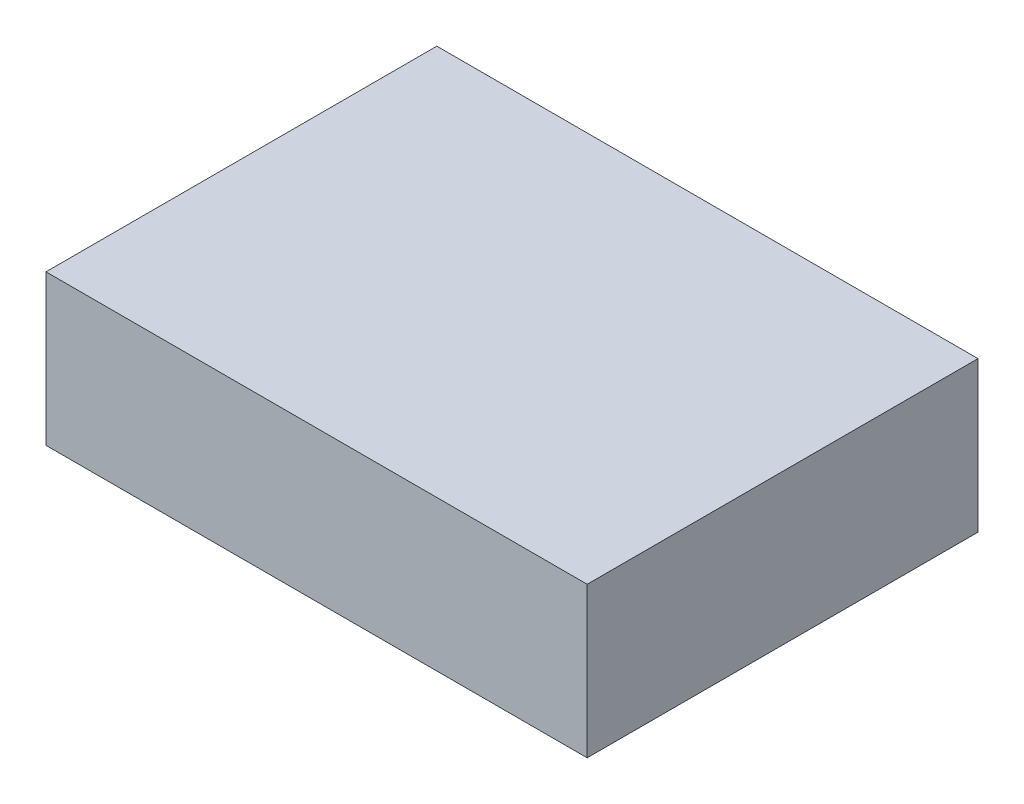
ISO-10303-21;
HEADER;
FILE_DESCRIPTION(('STEP AP214'),'2;1');
FILE_NAME('part.step','',(''),(''),'','','');
FILE_SCHEMA(('AUTOMOTIVE_DESIGN { 1 0 10303 214 1 1 1 1 }'));
ENDSEC;
DATA;
#1=APPLICATION_CONTEXT('core data for automotive mechanical design processes');
#2=APPLICATION_PROTOCOL_DEFINITION('international standard','automotive_design',2000,#1);
#3=PRODUCT_CONTEXT('',#1,'mechanical');
#4=PRODUCT('Part','Part','',(#3));
#5=PRODUCT_RELATED_PRODUCT_CATEGORY('part','',(#4));
#6=PRODUCT_DEFINITION_FORMATION('','',#4);
#7=PRODUCT_DEFINITION_CONTEXT('part definition',#1,'design');
#8=PRODUCT_DEFINITION('design','',#6,#7);
#9=PRODUCT_DEFINITION_SHAPE('','',#8);
#10=(LENGTH_UNIT() NAMED_UNIT(*) SI_UNIT(.MILLI.,.METRE.));
#11=(NAMED_UNIT(*) PLANE_ANGLE_UNIT() SI_UNIT($,.RADIAN.));
#12=(NAMED_UNIT(*) SI_UNIT($,.STERADIAN.) SOLID_ANGLE_UNIT());
#13=UNCERTAINTY_MEASURE_WITH_UNIT(LENGTH_MEASURE(1.E-05),#10,'distance_accuracy_value','');
#14=(GEOMETRIC_REPRESENTATION_CONTEXT(3) GLOBAL_UNCERTAINTY_ASSIGNED_CONTEXT((#13)) GLOBAL_UNIT_ASSIGNED_CONTEXT((#10,
#11,#12)) REPRESENTATION_CONTEXT('',''));
#15=CARTESIAN_POINT('',(0.,0.,0.));
#16=DIRECTION('',(0.,0.,1.));
#17=DIRECTION('',(1.,0.,0.));
#18=AXIS2_PLACEMENT_3D('',#15,#16,#17);
#19=CARTESIAN_POINT('',(0.90000074,0.25000204,0.));
#20=DIRECTION('',(0.,-1.,0.));
#21=DIRECTION('',(0.,0.,-1.));
#22=AXIS2_PLACEMENT_3D('',#19,#20,#21);
#23=PLANE('',#22);
#24=DIRECTION('',(0.,0.,-1.));
#25=VECTOR('',#24,1.);
#26=CARTESIAN_POINT('',(-0.8999982,0.25000204,0.));
#27=LINE('',#26,#25);
#28=CARTESIAN_POINT('',(-0.8999982,0.25000204,0.));
#29=VERTEX_POINT('',#28);
#30=CARTESIAN_POINT('',(-0.8999982,0.25000204,1.29999994));
#31=VERTEX_POINT('',#30);
#32=EDGE_CURVE('E20',#29,#31,#27,.F.);
#33=ORIENTED_EDGE('',*,*,#32,.T.);
#34=DIRECTION('',(-1.,0.,0.));
#35=VECTOR('',#34,1.);
#36=CARTESIAN_POINT('',(-0.8999982,0.25000204,1.29999994));
#37=LINE('',#36,#35);
#38=CARTESIAN_POINT('',(0.90000074,0.25000204,1.29999994));
#39=VERTEX_POINT('',#38);
#40=EDGE_CURVE('E55',#31,#39,#37,.F.);
#41=ORIENTED_EDGE('',*,*,#40,.T.);
#42=DIRECTION('',(0.,0.,1.));
#43=VECTOR('',#42,1.);
#44=CARTESIAN_POINT('',(0.90000074,0.25000204,0.));
#45=LINE('',#44,#43);
#46=CARTESIAN_POINT('',(0.90000074,0.25000204,0.));
#47=VERTEX_POINT('',#46);
#48=EDGE_CURVE('E76',#39,#47,#45,.F.);
#49=ORIENTED_EDGE('',*,*,#48,.T.);
#50=DIRECTION('',(-1.,0.,0.));
#51=VECTOR('',#50,1.);
#52=CARTESIAN_POINT('',(-0.8999982,0.25000204,0.));
#53=LINE('',#52,#51);
#54=EDGE_CURVE('E58',#29,#47,#53,.F.);
#55=ORIENTED_EDGE('',*,*,#54,.F.);
#56=EDGE_LOOP('',(#33,#41,#49,#55));
#57=FACE_BOUND('',#56,.T.);
#58=ADVANCED_FACE('F17',(#57),#23,.F.);
#59=CARTESIAN_POINT('',(-0.8999982,0.25000204,0.));
#60=DIRECTION('',(1.,0.,0.));
#61=DIRECTION('',(0.,0.,-1.));
#62=AXIS2_PLACEMENT_3D('',#59,#60,#61);
#63=PLANE('',#62);
#64=DIRECTION('',(0.,0.,1.));
#65=VECTOR('',#64,1.);
#66=CARTESIAN_POINT('',(-0.8999982,-0.2499995,0.));
#67=LINE('',#66,#65);
#68=CARTESIAN_POINT('',(-0.8999982,-0.2499995,0.));
#69=VERTEX_POINT('',#68);
#70=CARTESIAN_POINT('',(-0.8999982,-0.2499995,1.29999994));
#71=VERTEX_POINT('',#70);
#72=EDGE_CURVE('E73',#69,#71,#67,.T.);
#73=ORIENTED_EDGE('',*,*,#72,.T.);
#74=DIRECTION('',(0.,1.,0.));
#75=VECTOR('',#74,1.);
#76=CARTESIAN_POINT('',(-0.8999982,-0.2499995,1.29999994));
#77=LINE('',#76,#75);
#78=EDGE_CURVE('E63',#71,#31,#77,.T.);
#79=ORIENTED_EDGE('',*,*,#78,.T.);
#80=ORIENTED_EDGE('',*,*,#32,.F.);
#81=DIRECTION('',(0.,1.,0.));
#82=VECTOR('',#81,1.);
#83=CARTESIAN_POINT('',(-0.8999982,-0.2499995,0.));
#84=LINE('',#83,#82);
#85=EDGE_CURVE('E78',#69,#29,#84,.T.);
#86=ORIENTED_EDGE('',*,*,#85,.F.);
#87=EDGE_LOOP('',(#73,#79,#80,#86));
#88=FACE_BOUND('',#87,.T.);
#89=ADVANCED_FACE('F72',(#88),#63,.F.);
#90=CARTESIAN_POINT('',(-0.8999982,-0.2499995,1.29999994));
#91=DIRECTION('',(0.,0.,-1.));
#92=DIRECTION('',(-1.,0.,0.));
#93=AXIS2_PLACEMENT_3D('',#90,#91,#92);
#94=PLANE('',#93);
#95=DIRECTION('',(0.,1.,0.));
#96=VECTOR('',#95,1.);
#97=CARTESIAN_POINT('',(0.90000074,-0.2499995,1.29999994));
#98=LINE('',#97,#96);
#99=CARTESIAN_POINT('',(0.90000074,-0.2499995,1.29999994));
#100=VERTEX_POINT('',#99);
#101=EDGE_CURVE('E69',#100,#39,#98,.T.);
#102=ORIENTED_EDGE('',*,*,#101,.T.);
#103=ORIENTED_EDGE('',*,*,#40,.F.);
#104=ORIENTED_EDGE('',*,*,#78,.F.);
#105=DIRECTION('',(1.,0.,0.));
#106=VECTOR('',#105,1.);
#107=CARTESIAN_POINT('',(-0.8999982,-0.2499995,1.29999994));
#108=LINE('',#107,#106);
#109=EDGE_CURVE('E83',#71,#100,#108,.T.);
#110=ORIENTED_EDGE('',*,*,#109,.T.);
#111=EDGE_LOOP('',(#102,#103,#104,#110));
#112=FACE_BOUND('',#111,.T.);
#113=ADVANCED_FACE('F66',(#112),#94,.F.);
#114=CARTESIAN_POINT('',(0.90000074,-0.2499995,0.));
#115=DIRECTION('',(-1.,0.,0.));
#116=DIRECTION('',(0.,0.,1.));
#117=AXIS2_PLACEMENT_3D('',#114,#115,#116);
#118=PLANE('',#117);
#119=ORIENTED_EDGE('',*,*,#48,.F.);
#120=ORIENTED_EDGE('',*,*,#101,.F.);
#121=DIRECTION('',(0.,0.,1.));
#122=VECTOR('',#121,1.);
#123=CARTESIAN_POINT('',(0.90000074,-0.2499995,0.));
#124=LINE('',#123,#122);
#125=CARTESIAN_POINT('',(0.90000074,-0.2499995,0.));
#126=VERTEX_POINT('',#125);
#127=EDGE_CURVE('E26',#100,#126,#124,.F.);
#128=ORIENTED_EDGE('',*,*,#127,.T.);
#129=DIRECTION('',(0.,1.,0.));
#130=VECTOR('',#129,1.);
#131=CARTESIAN_POINT('',(0.90000074,-0.2499995,0.));
#132=LINE('',#131,#130);
#133=EDGE_CURVE('E34',#47,#126,#132,.F.);
#134=ORIENTED_EDGE('',*,*,#133,.F.);
#135=EDGE_LOOP('',(#119,#120,#128,#134));
#136=FACE_BOUND('',#135,.T.);
#137=ADVANCED_FACE('F88',(#136),#118,.F.);
#138=CARTESIAN_POINT('',(-0.8999982,-0.2499995,0.));
#139=DIRECTION('',(0.,0.,-1.));
#140=DIRECTION('',(-1.,0.,0.));
#141=AXIS2_PLACEMENT_3D('',#138,#139,#140);
#142=PLANE('',#141);
#143=ORIENTED_EDGE('',*,*,#133,.T.);
#144=DIRECTION('',(1.,0.,0.));
#145=VECTOR('',#144,1.);
#146=CARTESIAN_POINT('',(-0.8999982,-0.2499995,0.));
#147=LINE('',#146,#145);
#148=EDGE_CURVE('E11',#126,#69,#147,.F.);
#149=ORIENTED_EDGE('',*,*,#148,.T.);
#150=ORIENTED_EDGE('',*,*,#85,.T.);
#151=ORIENTED_EDGE('',*,*,#54,.T.);
#152=EDGE_LOOP('',(#143,#149,#150,#151));
#153=FACE_BOUND('',#152,.T.);
#154=ADVANCED_FACE('F91',(#153),#142,.T.);
#155=CARTESIAN_POINT('',(-0.8999982,-0.2499995,0.));
#156=DIRECTION('',(0.,1.,0.));
#157=DIRECTION('',(0.,0.,1.));
#158=AXIS2_PLACEMENT_3D('',#155,#156,#157);
#159=PLANE('',#158);
#160=ORIENTED_EDGE('',*,*,#127,.F.);
#161=ORIENTED_EDGE('',*,*,#109,.F.);
#162=ORIENTED_EDGE('',*,*,#72,.F.);
#163=ORIENTED_EDGE('',*,*,#148,.F.);
#164=EDGE_LOOP('',(#160,#161,#162,#163));
#165=FACE_BOUND('',#164,.T.);
#166=ADVANCED_FACE('F90',(#165),#159,.F.);
#167=CLOSED_SHELL('',(#58,#89,#113,#137,#154,#166));
#168=MANIFOLD_SOLID_BREP('B1',#167);
#169=ADVANCED_BREP_SHAPE_REPRESENTATION('',(#18,#168),#14);
#170=SHAPE_DEFINITION_REPRESENTATION(#9,#169);
ENDSEC;
END-ISO-10303-21;
